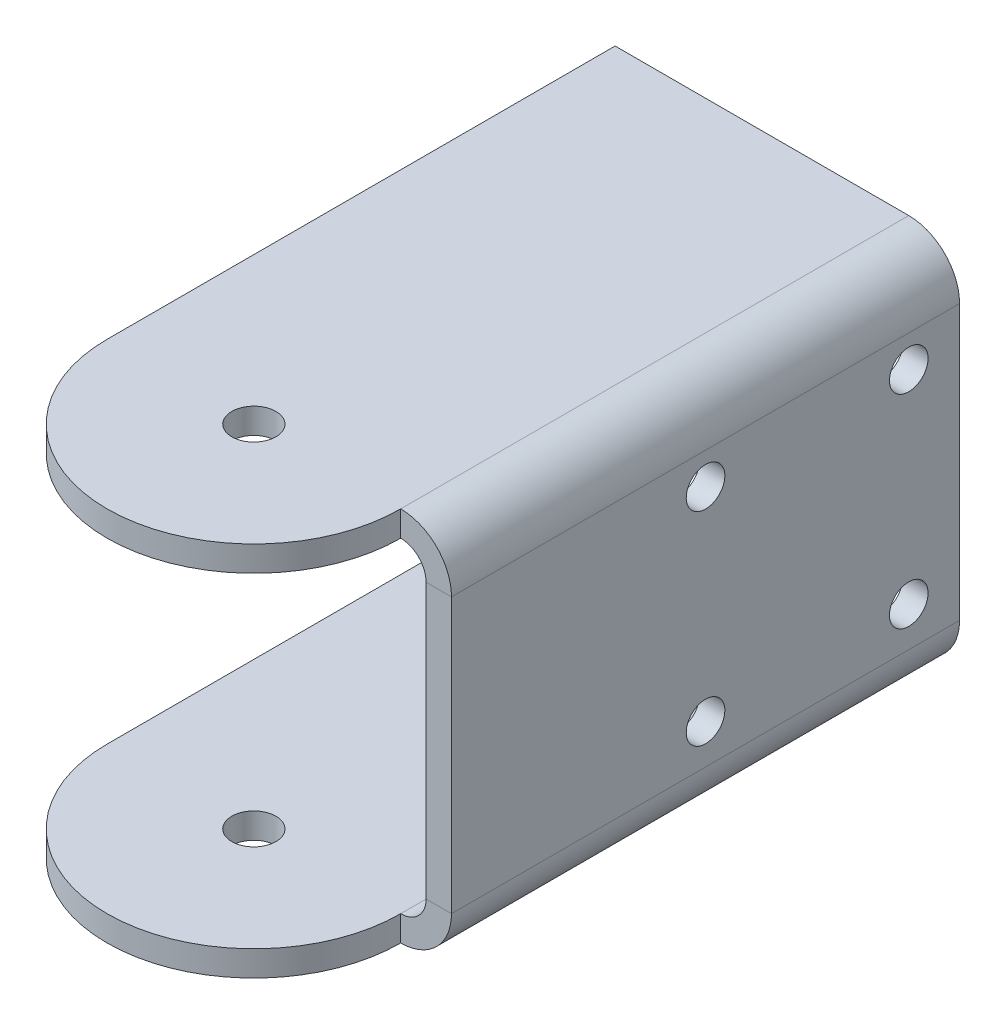
ISO-10303-21;
HEADER;
FILE_DESCRIPTION(('STEP AP214'),'2;1');
FILE_NAME('part.step','',(''),(''),'','','');
FILE_SCHEMA(('AUTOMOTIVE_DESIGN { 1 0 10303 214 1 1 1 1 }'));
ENDSEC;
DATA;
#1=APPLICATION_CONTEXT('core data for automotive mechanical design processes');
#2=APPLICATION_PROTOCOL_DEFINITION('international standard','automotive_design',2000,#1);
#3=PRODUCT_CONTEXT('',#1,'mechanical');
#4=PRODUCT('Part','Part','',(#3));
#5=PRODUCT_RELATED_PRODUCT_CATEGORY('part','',(#4));
#6=PRODUCT_DEFINITION_FORMATION('','',#4);
#7=PRODUCT_DEFINITION_CONTEXT('part definition',#1,'design');
#8=PRODUCT_DEFINITION('design','',#6,#7);
#9=PRODUCT_DEFINITION_SHAPE('','',#8);
#10=(LENGTH_UNIT() NAMED_UNIT(*) SI_UNIT(.MILLI.,.METRE.));
#11=(NAMED_UNIT(*) PLANE_ANGLE_UNIT() SI_UNIT($,.RADIAN.));
#12=(NAMED_UNIT(*) SI_UNIT($,.STERADIAN.) SOLID_ANGLE_UNIT());
#13=UNCERTAINTY_MEASURE_WITH_UNIT(LENGTH_MEASURE(1.E-05),#10,'distance_accuracy_value','');
#14=(GEOMETRIC_REPRESENTATION_CONTEXT(3) GLOBAL_UNCERTAINTY_ASSIGNED_CONTEXT((#13)) GLOBAL_UNIT_ASSIGNED_CONTEXT((#10,
#11,#12)) REPRESENTATION_CONTEXT('',''));
#15=CARTESIAN_POINT('',(0.,0.,0.));
#16=DIRECTION('',(0.,0.,1.));
#17=DIRECTION('',(1.,0.,0.));
#18=AXIS2_PLACEMENT_3D('',#15,#16,#17);
#19=CARTESIAN_POINT('',(-3.17500000000001,20.32,63.5));
#20=DIRECTION('',(0.,0.,1.));
#21=DIRECTION('',(1.,0.,0.));
#22=AXIS2_PLACEMENT_3D('',#19,#20,#21);
#23=PLANE('',#22);
#24=DIRECTION('',(0.,1.,0.));
#25=VECTOR('',#24,1.);
#26=CARTESIAN_POINT('',(-3.17500000000001,20.32,63.5));
#27=LINE('',#26,#25);
#28=CARTESIAN_POINT('',(-3.17500000000001,20.32,63.5));
#29=VERTEX_POINT('',#28);
#30=CARTESIAN_POINT('',(-3.17500000000001,23.495,63.5));
#31=VERTEX_POINT('',#30);
#32=EDGE_CURVE('E11',#29,#31,#27,.T.);
#33=ORIENTED_EDGE('',*,*,#32,.F.);
#34=CARTESIAN_POINT('',(-3.17500000000001,17.145,63.5));
#35=DIRECTION('',(0.,0.,1.));
#36=DIRECTION('',(1.,0.,0.));
#37=AXIS2_PLACEMENT_3D('',#34,#35,#36);
#38=CIRCLE('',#37,3.175);
#39=CARTESIAN_POINT('',(0.,17.145,63.5));
#40=VERTEX_POINT('',#39);
#41=EDGE_CURVE('E154',#29,#40,#38,.F.);
#42=ORIENTED_EDGE('',*,*,#41,.T.);
#43=DIRECTION('',(-1.,0.,0.));
#44=VECTOR('',#43,1.);
#45=CARTESIAN_POINT('',(3.17499999999999,17.145,63.5));
#46=LINE('',#45,#44);
#47=CARTESIAN_POINT('',(3.17499999999999,17.145,63.5));
#48=VERTEX_POINT('',#47);
#49=EDGE_CURVE('E51',#48,#40,#46,.T.);
#50=ORIENTED_EDGE('',*,*,#49,.F.);
#51=CARTESIAN_POINT('',(-3.17500000000001,17.145,63.5));
#52=DIRECTION('',(0.,0.,1.));
#53=DIRECTION('',(1.,0.,0.));
#54=AXIS2_PLACEMENT_3D('',#51,#52,#53);
#55=CIRCLE('',#54,6.35);
#56=EDGE_CURVE('E155',#31,#48,#55,.F.);
#57=ORIENTED_EDGE('',*,*,#56,.F.);
#58=EDGE_LOOP('',(#33,#42,#50,#57));
#59=FACE_BOUND('',#58,.T.);
#60=ADVANCED_FACE('F42',(#59),#23,.T.);
#61=CARTESIAN_POINT('',(0.,17.145,0.));
#62=DIRECTION('',(0.,0.,-1.));
#63=DIRECTION('',(-1.,0.,0.));
#64=AXIS2_PLACEMENT_3D('',#61,#62,#63);
#65=PLANE('',#64);
#66=DIRECTION('',(1.,0.,0.));
#67=VECTOR('',#66,1.);
#68=CARTESIAN_POINT('',(0.,17.145,0.));
#69=LINE('',#68,#67);
#70=CARTESIAN_POINT('',(0.,17.145,0.));
#71=VERTEX_POINT('',#70);
#72=CARTESIAN_POINT('',(3.17499999999999,17.145,0.));
#73=VERTEX_POINT('',#72);
#74=EDGE_CURVE('E248',#71,#73,#69,.T.);
#75=ORIENTED_EDGE('',*,*,#74,.F.);
#76=CARTESIAN_POINT('',(-3.17500000000001,17.145,0.));
#77=DIRECTION('',(0.,0.,1.));
#78=DIRECTION('',(1.,0.,0.));
#79=AXIS2_PLACEMENT_3D('',#76,#77,#78);
#80=CIRCLE('',#79,3.175);
#81=CARTESIAN_POINT('',(-3.17500000000001,20.32,0.));
#82=VERTEX_POINT('',#81);
#83=EDGE_CURVE('E208',#82,#71,#80,.F.);
#84=ORIENTED_EDGE('',*,*,#83,.F.);
#85=DIRECTION('',(0.,-1.,0.));
#86=VECTOR('',#85,1.);
#87=CARTESIAN_POINT('',(-3.17500000000001,23.495,0.));
#88=LINE('',#87,#86);
#89=CARTESIAN_POINT('',(-3.17500000000001,23.495,0.));
#90=VERTEX_POINT('',#89);
#91=EDGE_CURVE('E246',#90,#82,#88,.T.);
#92=ORIENTED_EDGE('',*,*,#91,.F.);
#93=CARTESIAN_POINT('',(-3.17500000000001,17.145,0.));
#94=DIRECTION('',(0.,0.,1.));
#95=DIRECTION('',(1.,0.,0.));
#96=AXIS2_PLACEMENT_3D('',#93,#94,#95);
#97=CIRCLE('',#96,6.35);
#98=EDGE_CURVE('E199',#90,#73,#97,.F.);
#99=ORIENTED_EDGE('',*,*,#98,.T.);
#100=EDGE_LOOP('',(#75,#84,#92,#99));
#101=FACE_BOUND('',#100,.T.);
#102=ADVANCED_FACE('F338',(#101),#65,.T.);
#103=CARTESIAN_POINT('',(-3.17500000000001,23.495,0.));
#104=DIRECTION('',(0.,0.,-1.));
#105=DIRECTION('',(-1.,0.,0.));
#106=AXIS2_PLACEMENT_3D('',#103,#104,#105);
#107=PLANE('',#106);
#108=DIRECTION('',(0.,-1.,0.));
#109=VECTOR('',#108,1.);
#110=CARTESIAN_POINT('',(0.,-20.32,0.));
#111=LINE('',#110,#109);
#112=CARTESIAN_POINT('',(0.,-17.145,0.));
#113=VERTEX_POINT('',#112);
#114=EDGE_CURVE('E211',#71,#113,#111,.T.);
#115=ORIENTED_EDGE('',*,*,#114,.F.);
#116=ORIENTED_EDGE('',*,*,#74,.T.);
#117=DIRECTION('',(0.,-1.,0.));
#118=VECTOR('',#117,1.);
#119=CARTESIAN_POINT('',(3.175,-20.32,0.));
#120=LINE('',#119,#118);
#121=CARTESIAN_POINT('',(3.175,-17.145,0.));
#122=VERTEX_POINT('',#121);
#123=EDGE_CURVE('E197',#73,#122,#120,.T.);
#124=ORIENTED_EDGE('',*,*,#123,.T.);
#125=DIRECTION('',(-1.,0.,0.));
#126=VECTOR('',#125,1.);
#127=CARTESIAN_POINT('',(3.175,-17.145,0.));
#128=LINE('',#127,#126);
#129=EDGE_CURVE('E101',#122,#113,#128,.T.);
#130=ORIENTED_EDGE('',*,*,#129,.T.);
#131=EDGE_LOOP('',(#115,#116,#124,#130));
#132=FACE_BOUND('',#131,.T.);
#133=ADVANCED_FACE('F342',(#132),#107,.T.);
#134=CARTESIAN_POINT('',(0.,-17.145,63.5));
#135=DIRECTION('',(0.,0.,1.));
#136=DIRECTION('',(1.,0.,0.));
#137=AXIS2_PLACEMENT_3D('',#134,#135,#136);
#138=PLANE('',#137);
#139=DIRECTION('',(1.,0.,0.));
#140=VECTOR('',#139,1.);
#141=CARTESIAN_POINT('',(0.,-17.145,63.5));
#142=LINE('',#141,#140);
#143=CARTESIAN_POINT('',(0.,-17.145,63.5));
#144=VERTEX_POINT('',#143);
#145=CARTESIAN_POINT('',(3.175,-17.145,63.5));
#146=VERTEX_POINT('',#145);
#147=EDGE_CURVE('E59',#144,#146,#142,.T.);
#148=ORIENTED_EDGE('',*,*,#147,.F.);
#149=CARTESIAN_POINT('',(-3.175,-17.145,63.5));
#150=DIRECTION('',(0.,0.,1.));
#151=DIRECTION('',(1.,0.,0.));
#152=AXIS2_PLACEMENT_3D('',#149,#150,#151);
#153=CIRCLE('',#152,3.175);
#154=CARTESIAN_POINT('',(-3.17500000000001,-20.32,63.5));
#155=VERTEX_POINT('',#154);
#156=EDGE_CURVE('E187',#144,#155,#153,.F.);
#157=ORIENTED_EDGE('',*,*,#156,.T.);
#158=DIRECTION('',(0.,1.,0.));
#159=VECTOR('',#158,1.);
#160=CARTESIAN_POINT('',(-3.175,-23.495,63.5));
#161=LINE('',#160,#159);
#162=CARTESIAN_POINT('',(-3.17500000000001,-23.495,63.5));
#163=VERTEX_POINT('',#162);
#164=EDGE_CURVE('E242',#163,#155,#161,.T.);
#165=ORIENTED_EDGE('',*,*,#164,.F.);
#166=CARTESIAN_POINT('',(-3.175,-17.145,63.5));
#167=DIRECTION('',(0.,0.,1.));
#168=DIRECTION('',(1.,0.,0.));
#169=AXIS2_PLACEMENT_3D('',#166,#167,#168);
#170=CIRCLE('',#169,6.35);
#171=EDGE_CURVE('E174',#146,#163,#170,.F.);
#172=ORIENTED_EDGE('',*,*,#171,.F.);
#173=EDGE_LOOP('',(#148,#157,#165,#172));
#174=FACE_BOUND('',#173,.T.);
#175=ADVANCED_FACE('F271',(#174),#138,.T.);
#176=CARTESIAN_POINT('',(-3.175,-23.495,63.5));
#177=DIRECTION('',(0.,0.,1.));
#178=DIRECTION('',(1.,0.,0.));
#179=AXIS2_PLACEMENT_3D('',#176,#177,#178);
#180=PLANE('',#179);
#181=DIRECTION('',(0.,-1.,0.));
#182=VECTOR('',#181,1.);
#183=CARTESIAN_POINT('',(0.,-20.32,63.5));
#184=LINE('',#183,#182);
#185=EDGE_CURVE('E185',#40,#144,#184,.T.);
#186=ORIENTED_EDGE('',*,*,#185,.T.);
#187=ORIENTED_EDGE('',*,*,#147,.T.);
#188=DIRECTION('',(0.,-1.,0.));
#189=VECTOR('',#188,1.);
#190=CARTESIAN_POINT('',(3.175,-20.32,63.5));
#191=LINE('',#190,#189);
#192=EDGE_CURVE('E178',#48,#146,#191,.T.);
#193=ORIENTED_EDGE('',*,*,#192,.F.);
#194=ORIENTED_EDGE('',*,*,#49,.T.);
#195=EDGE_LOOP('',(#186,#187,#193,#194));
#196=FACE_BOUND('',#195,.T.);
#197=ADVANCED_FACE('F252',(#196),#180,.T.);
#198=CARTESIAN_POINT('',(-3.175,-20.32,0.));
#199=DIRECTION('',(0.,0.,-1.));
#200=DIRECTION('',(-1.,0.,0.));
#201=AXIS2_PLACEMENT_3D('',#198,#199,#200);
#202=PLANE('',#201);
#203=DIRECTION('',(0.,-1.,0.));
#204=VECTOR('',#203,1.);
#205=CARTESIAN_POINT('',(-3.175,-20.32,0.));
#206=LINE('',#205,#204);
#207=CARTESIAN_POINT('',(-3.175,-20.32,0.));
#208=VERTEX_POINT('',#207);
#209=CARTESIAN_POINT('',(-3.175,-23.495,0.));
#210=VERTEX_POINT('',#209);
#211=EDGE_CURVE('E108',#208,#210,#206,.T.);
#212=ORIENTED_EDGE('',*,*,#211,.F.);
#213=CARTESIAN_POINT('',(-3.175,-17.145,0.));
#214=DIRECTION('',(0.,0.,1.));
#215=DIRECTION('',(1.,0.,0.));
#216=AXIS2_PLACEMENT_3D('',#213,#214,#215);
#217=CIRCLE('',#216,3.175);
#218=EDGE_CURVE('E175',#113,#208,#217,.F.);
#219=ORIENTED_EDGE('',*,*,#218,.F.);
#220=ORIENTED_EDGE('',*,*,#129,.F.);
#221=CARTESIAN_POINT('',(-3.175,-17.145,0.));
#222=DIRECTION('',(0.,0.,1.));
#223=DIRECTION('',(1.,0.,0.));
#224=AXIS2_PLACEMENT_3D('',#221,#222,#223);
#225=CIRCLE('',#224,6.35);
#226=EDGE_CURVE('E195',#122,#210,#225,.F.);
#227=ORIENTED_EDGE('',*,*,#226,.T.);
#228=EDGE_LOOP('',(#212,#219,#220,#227));
#229=FACE_BOUND('',#228,.T.);
#230=ADVANCED_FACE('F353',(#229),#202,.T.);
#231=CARTESIAN_POINT('',(3.175,-17.145,0.));
#232=DIRECTION('',(0.,0.,-1.));
#233=DIRECTION('',(-1.,0.,0.));
#234=AXIS2_PLACEMENT_3D('',#231,#232,#233);
#235=PLANE('',#234);
#236=DIRECTION('',(-1.,0.,0.));
#237=VECTOR('',#236,1.);
#238=CARTESIAN_POINT('',(0.,-20.32,0.));
#239=LINE('',#238,#237);
#240=CARTESIAN_POINT('',(-39.878,-20.32,0.));
#241=VERTEX_POINT('',#240);
#242=EDGE_CURVE('E161',#208,#241,#239,.T.);
#243=ORIENTED_EDGE('',*,*,#242,.F.);
#244=ORIENTED_EDGE('',*,*,#211,.T.);
#245=DIRECTION('',(1.,0.,0.));
#246=VECTOR('',#245,1.);
#247=CARTESIAN_POINT('',(0.,-23.495,0.));
#248=LINE('',#247,#246);
#249=CARTESIAN_POINT('',(-39.878,-23.495,0.));
#250=VERTEX_POINT('',#249);
#251=EDGE_CURVE('E192',#210,#250,#248,.F.);
#252=ORIENTED_EDGE('',*,*,#251,.T.);
#253=DIRECTION('',(0.,1.,0.));
#254=VECTOR('',#253,1.);
#255=CARTESIAN_POINT('',(-39.878,-23.495,0.));
#256=LINE('',#255,#254);
#257=EDGE_CURVE('E164',#250,#241,#256,.T.);
#258=ORIENTED_EDGE('',*,*,#257,.T.);
#259=EDGE_LOOP('',(#243,#244,#252,#258));
#260=FACE_BOUND('',#259,.T.);
#261=ADVANCED_FACE('F356',(#260),#235,.T.);
#262=CARTESIAN_POINT('',(0.,-20.32,63.5));
#263=DIRECTION('',(0.,-1.,0.));
#264=DIRECTION('',(0.,0.,-1.));
#265=AXIS2_PLACEMENT_3D('',#262,#263,#264);
#266=PLANE('',#265);
#267=CARTESIAN_POINT('',(-21.5265,-20.32,63.5));
#268=DIRECTION('',(0.,-1.,0.));
#269=DIRECTION('',(0.,0.,-1.));
#270=AXIS2_PLACEMENT_3D('',#267,#268,#269);
#271=CIRCLE('',#270,2.753999953);
#272=CARTESIAN_POINT('',(-21.5265,-20.32,60.746000047));
#273=VERTEX_POINT('',#272);
#274=EDGE_CURVE('E295',#273,#273,#271,.T.);
#275=ORIENTED_EDGE('',*,*,#274,.T.);
#276=EDGE_LOOP('',(#275));
#277=FACE_BOUND('',#276,.T.);
#278=ORIENTED_EDGE('',*,*,#242,.T.);
#279=DIRECTION('',(0.,0.,-1.));
#280=VECTOR('',#279,1.);
#281=CARTESIAN_POINT('',(-39.878,-20.32,63.5));
#282=LINE('',#281,#280);
#283=CARTESIAN_POINT('',(-39.878,-20.32,63.4999999999999));
#284=VERTEX_POINT('',#283);
#285=EDGE_CURVE('E238',#284,#241,#282,.T.);
#286=ORIENTED_EDGE('',*,*,#285,.F.);
#287=CARTESIAN_POINT('',(-21.5265,-20.32,63.4999999999999));
#288=DIRECTION('',(0.,-1.,0.));
#289=DIRECTION('',(0.,0.,1.));
#290=AXIS2_PLACEMENT_3D('',#287,#288,#289);
#291=CIRCLE('',#290,18.3515);
#292=EDGE_CURVE('E166',#155,#284,#291,.T.);
#293=ORIENTED_EDGE('',*,*,#292,.F.);
#294=DIRECTION('',(0.,0.,-1.));
#295=VECTOR('',#294,1.);
#296=CARTESIAN_POINT('',(-3.175,-20.32,63.5));
#297=LINE('',#296,#295);
#298=EDGE_CURVE('E188',#155,#208,#297,.T.);
#299=ORIENTED_EDGE('',*,*,#298,.T.);
#300=EDGE_LOOP('',(#278,#286,#293,#299));
#301=FACE_BOUND('',#300,.T.);
#302=ADVANCED_FACE('F359',(#277,#301),#266,.F.);
#303=CARTESIAN_POINT('',(-39.878,-23.495,63.5));
#304=DIRECTION('',(-1.,0.,0.));
#305=DIRECTION('',(0.,0.,1.));
#306=AXIS2_PLACEMENT_3D('',#303,#304,#305);
#307=PLANE('',#306);
#308=ORIENTED_EDGE('',*,*,#257,.F.);
#309=DIRECTION('',(0.,0.,-1.));
#310=VECTOR('',#309,1.);
#311=CARTESIAN_POINT('',(-39.878,-23.495,63.5));
#312=LINE('',#311,#310);
#313=CARTESIAN_POINT('',(-39.878,-23.495,63.5));
#314=VERTEX_POINT('',#313);
#315=EDGE_CURVE('E236',#314,#250,#312,.T.);
#316=ORIENTED_EDGE('',*,*,#315,.F.);
#317=DIRECTION('',(0.,1.,0.));
#318=VECTOR('',#317,1.);
#319=CARTESIAN_POINT('',(-39.878,-23.495,63.5));
#320=LINE('',#319,#318);
#321=EDGE_CURVE('E171',#314,#284,#320,.T.);
#322=ORIENTED_EDGE('',*,*,#321,.T.);
#323=ORIENTED_EDGE('',*,*,#285,.T.);
#324=EDGE_LOOP('',(#308,#316,#322,#323));
#325=FACE_BOUND('',#324,.T.);
#326=ADVANCED_FACE('F363',(#325),#307,.T.);
#327=CARTESIAN_POINT('',(0.,-23.495,63.5));
#328=DIRECTION('',(0.,-1.,0.));
#329=DIRECTION('',(0.,0.,-1.));
#330=AXIS2_PLACEMENT_3D('',#327,#328,#329);
#331=PLANE('',#330);
#332=CARTESIAN_POINT('',(-21.5265,-23.495,63.5));
#333=DIRECTION('',(0.,1.,0.));
#334=DIRECTION('',(-1.,0.,0.));
#335=AXIS2_PLACEMENT_3D('',#332,#333,#334);
#336=CIRCLE('',#335,2.753999953);
#337=CARTESIAN_POINT('',(-24.280499953,-23.495,63.5));
#338=VERTEX_POINT('',#337);
#339=EDGE_CURVE('E314',#338,#338,#336,.T.);
#340=ORIENTED_EDGE('',*,*,#339,.T.);
#341=EDGE_LOOP('',(#340));
#342=FACE_BOUND('',#341,.T.);
#343=ORIENTED_EDGE('',*,*,#251,.F.);
#344=DIRECTION('',(0.,0.,-1.));
#345=VECTOR('',#344,1.);
#346=CARTESIAN_POINT('',(-3.175,-23.495,63.5));
#347=LINE('',#346,#345);
#348=EDGE_CURVE('E233',#163,#210,#347,.T.);
#349=ORIENTED_EDGE('',*,*,#348,.F.);
#350=CARTESIAN_POINT('',(-21.5265,-23.495,63.4999999999999));
#351=DIRECTION('',(0.,-1.,0.));
#352=DIRECTION('',(0.,0.,1.));
#353=AXIS2_PLACEMENT_3D('',#350,#351,#352);
#354=CIRCLE('',#353,18.3515);
#355=EDGE_CURVE('E116',#163,#314,#354,.T.);
#356=ORIENTED_EDGE('',*,*,#355,.T.);
#357=ORIENTED_EDGE('',*,*,#315,.T.);
#358=EDGE_LOOP('',(#343,#349,#356,#357));
#359=FACE_BOUND('',#358,.T.);
#360=ADVANCED_FACE('F367',(#342,#359),#331,.T.);
#361=CARTESIAN_POINT('',(-3.175,-17.145,63.5));
#362=DIRECTION('',(0.,0.,-1.));
#363=DIRECTION('',(-1.,0.,0.));
#364=AXIS2_PLACEMENT_3D('',#361,#362,#363);
#365=CYLINDRICAL_SURFACE('',#364,6.35);
#366=ORIENTED_EDGE('',*,*,#226,.F.);
#367=DIRECTION('',(0.,0.,-1.));
#368=VECTOR('',#367,1.);
#369=CARTESIAN_POINT('',(3.175,-17.145,63.5));
#370=LINE('',#369,#368);
#371=EDGE_CURVE('E230',#146,#122,#370,.T.);
#372=ORIENTED_EDGE('',*,*,#371,.F.);
#373=ORIENTED_EDGE('',*,*,#171,.T.);
#374=ORIENTED_EDGE('',*,*,#348,.T.);
#375=EDGE_LOOP('',(#366,#372,#373,#374));
#376=FACE_BOUND('',#375,.T.);
#377=ADVANCED_FACE('F371',(#376),#365,.T.);
#378=CARTESIAN_POINT('',(3.175,-20.32,63.5));
#379=DIRECTION('',(1.,0.,0.));
#380=DIRECTION('',(0.,1.,0.));
#381=AXIS2_PLACEMENT_3D('',#378,#379,#380);
#382=PLANE('',#381);
#383=CARTESIAN_POINT('',(3.175,-12.2133720603264,6.35));
#384=DIRECTION('',(1.,0.,0.));
#385=DIRECTION('',(0.,1.,0.));
#386=AXIS2_PLACEMENT_3D('',#383,#384,#385);
#387=CIRCLE('',#386,2.413);
#388=CARTESIAN_POINT('',(3.175,-9.8003720603264,6.35));
#389=VERTEX_POINT('',#388);
#390=EDGE_CURVE('E294',#389,#389,#387,.T.);
#391=ORIENTED_EDGE('',*,*,#390,.F.);
#392=EDGE_LOOP('',(#391));
#393=FACE_BOUND('',#392,.T.);
#394=CARTESIAN_POINT('',(3.175,-12.2133720603264,31.75));
#395=DIRECTION('',(1.,0.,0.));
#396=DIRECTION('',(0.,1.,0.));
#397=AXIS2_PLACEMENT_3D('',#394,#395,#396);
#398=CIRCLE('',#397,2.41299999999999);
#399=CARTESIAN_POINT('',(3.175,-9.8003720603264,31.75));
#400=VERTEX_POINT('',#399);
#401=EDGE_CURVE('E301',#400,#400,#398,.T.);
#402=ORIENTED_EDGE('',*,*,#401,.F.);
#403=EDGE_LOOP('',(#402));
#404=FACE_BOUND('',#403,.T.);
#405=CARTESIAN_POINT('',(3.17499999999999,13.1866279396736,31.75));
#406=DIRECTION('',(1.,0.,0.));
#407=DIRECTION('',(0.,1.,0.));
#408=AXIS2_PLACEMENT_3D('',#405,#406,#407);
#409=CIRCLE('',#408,2.41299999999999);
#410=CARTESIAN_POINT('',(3.17499999999999,15.5996279396736,31.75));
#411=VERTEX_POINT('',#410);
#412=EDGE_CURVE('E288',#411,#411,#409,.T.);
#413=ORIENTED_EDGE('',*,*,#412,.F.);
#414=EDGE_LOOP('',(#413));
#415=FACE_BOUND('',#414,.T.);
#416=CARTESIAN_POINT('',(3.17499999999999,13.1866279396736,6.35));
#417=DIRECTION('',(1.,0.,0.));
#418=DIRECTION('',(0.,1.,0.));
#419=AXIS2_PLACEMENT_3D('',#416,#417,#418);
#420=CIRCLE('',#419,2.413);
#421=CARTESIAN_POINT('',(3.17499999999999,15.5996279396736,6.35));
#422=VERTEX_POINT('',#421);
#423=EDGE_CURVE('E283',#422,#422,#420,.T.);
#424=ORIENTED_EDGE('',*,*,#423,.F.);
#425=EDGE_LOOP('',(#424));
#426=FACE_BOUND('',#425,.T.);
#427=ORIENTED_EDGE('',*,*,#123,.F.);
#428=DIRECTION('',(0.,0.,-1.));
#429=VECTOR('',#428,1.);
#430=CARTESIAN_POINT('',(3.17499999999999,17.145,63.5));
#431=LINE('',#430,#429);
#432=EDGE_CURVE('E227',#48,#73,#431,.T.);
#433=ORIENTED_EDGE('',*,*,#432,.F.);
#434=ORIENTED_EDGE('',*,*,#192,.T.);
#435=ORIENTED_EDGE('',*,*,#371,.T.);
#436=EDGE_LOOP('',(#427,#433,#434,#435));
#437=FACE_BOUND('',#436,.T.);
#438=ADVANCED_FACE('F374',(#393,#404,#415,#426,#437),#382,.T.);
#439=CARTESIAN_POINT('',(-3.17500000000001,17.145,63.5));
#440=DIRECTION('',(0.,0.,-1.));
#441=DIRECTION('',(-1.,0.,0.));
#442=AXIS2_PLACEMENT_3D('',#439,#440,#441);
#443=CYLINDRICAL_SURFACE('',#442,6.35);
#444=ORIENTED_EDGE('',*,*,#98,.F.);
#445=DIRECTION('',(0.,0.,-1.));
#446=VECTOR('',#445,1.);
#447=CARTESIAN_POINT('',(-3.17500000000001,23.495,63.5));
#448=LINE('',#447,#446);
#449=EDGE_CURVE('E224',#31,#90,#448,.T.);
#450=ORIENTED_EDGE('',*,*,#449,.F.);
#451=ORIENTED_EDGE('',*,*,#56,.T.);
#452=ORIENTED_EDGE('',*,*,#432,.T.);
#453=EDGE_LOOP('',(#444,#450,#451,#452));
#454=FACE_BOUND('',#453,.T.);
#455=ADVANCED_FACE('F378',(#454),#443,.T.);
#456=CARTESIAN_POINT('',(0.,23.495,63.5));
#457=DIRECTION('',(0.,1.,0.));
#458=DIRECTION('',(-1.,0.,0.));
#459=AXIS2_PLACEMENT_3D('',#456,#457,#458);
#460=PLANE('',#459);
#461=CARTESIAN_POINT('',(-21.5265,23.495,63.5));
#462=DIRECTION('',(0.,1.,0.));
#463=DIRECTION('',(-1.,0.,0.));
#464=AXIS2_PLACEMENT_3D('',#461,#462,#463);
#465=CIRCLE('',#464,2.753999953);
#466=CARTESIAN_POINT('',(-24.280499953,23.495,63.5));
#467=VERTEX_POINT('',#466);
#468=EDGE_CURVE('E311',#467,#467,#465,.T.);
#469=ORIENTED_EDGE('',*,*,#468,.F.);
#470=EDGE_LOOP('',(#469));
#471=FACE_BOUND('',#470,.T.);
#472=DIRECTION('',(1.,0.,0.));
#473=VECTOR('',#472,1.);
#474=CARTESIAN_POINT('',(0.,23.495,0.));
#475=LINE('',#474,#473);
#476=CARTESIAN_POINT('',(-39.878,23.495,0.));
#477=VERTEX_POINT('',#476);
#478=EDGE_CURVE('E202',#477,#90,#475,.T.);
#479=ORIENTED_EDGE('',*,*,#478,.F.);
#480=DIRECTION('',(0.,0.,-1.));
#481=VECTOR('',#480,1.);
#482=CARTESIAN_POINT('',(-39.878,23.495,63.5));
#483=LINE('',#482,#481);
#484=CARTESIAN_POINT('',(-39.878,23.495,63.5));
#485=VERTEX_POINT('',#484);
#486=EDGE_CURVE('E145',#485,#477,#483,.T.);
#487=ORIENTED_EDGE('',*,*,#486,.F.);
#488=CARTESIAN_POINT('',(-21.5265,23.495,63.5));
#489=DIRECTION('',(0.,1.,0.));
#490=DIRECTION('',(-1.,0.,0.));
#491=AXIS2_PLACEMENT_3D('',#488,#489,#490);
#492=CIRCLE('',#491,18.3515);
#493=EDGE_CURVE('E153',#485,#31,#492,.T.);
#494=ORIENTED_EDGE('',*,*,#493,.T.);
#495=ORIENTED_EDGE('',*,*,#449,.T.);
#496=EDGE_LOOP('',(#479,#487,#494,#495));
#497=FACE_BOUND('',#496,.T.);
#498=ADVANCED_FACE('F382',(#471,#497),#460,.T.);
#499=CARTESIAN_POINT('',(-39.878,20.32,63.5));
#500=DIRECTION('',(-1.,0.,0.));
#501=DIRECTION('',(0.,0.,1.));
#502=AXIS2_PLACEMENT_3D('',#499,#500,#501);
#503=PLANE('',#502);
#504=DIRECTION('',(0.,1.,0.));
#505=VECTOR('',#504,1.);
#506=CARTESIAN_POINT('',(-39.878,20.32,0.));
#507=LINE('',#506,#505);
#508=CARTESIAN_POINT('',(-39.878,20.32,0.));
#509=VERTEX_POINT('',#508);
#510=EDGE_CURVE('E140',#509,#477,#507,.T.);
#511=ORIENTED_EDGE('',*,*,#510,.F.);
#512=DIRECTION('',(0.,0.,-1.));
#513=VECTOR('',#512,1.);
#514=CARTESIAN_POINT('',(-39.878,20.32,63.5));
#515=LINE('',#514,#513);
#516=CARTESIAN_POINT('',(-39.878,20.32,63.5));
#517=VERTEX_POINT('',#516);
#518=EDGE_CURVE('E134',#517,#509,#515,.T.);
#519=ORIENTED_EDGE('',*,*,#518,.F.);
#520=DIRECTION('',(0.,1.,0.));
#521=VECTOR('',#520,1.);
#522=CARTESIAN_POINT('',(-39.878,20.32,63.5));
#523=LINE('',#522,#521);
#524=EDGE_CURVE('E137',#517,#485,#523,.T.);
#525=ORIENTED_EDGE('',*,*,#524,.T.);
#526=ORIENTED_EDGE('',*,*,#486,.T.);
#527=EDGE_LOOP('',(#511,#519,#525,#526));
#528=FACE_BOUND('',#527,.T.);
#529=ADVANCED_FACE('F136',(#528),#503,.T.);
#530=CARTESIAN_POINT('',(0.,20.32,63.5));
#531=DIRECTION('',(0.,1.,0.));
#532=DIRECTION('',(-1.,0.,0.));
#533=AXIS2_PLACEMENT_3D('',#530,#531,#532);
#534=PLANE('',#533);
#535=CARTESIAN_POINT('',(-21.5265,20.32,63.5));
#536=DIRECTION('',(0.,1.,0.));
#537=DIRECTION('',(-1.,0.,0.));
#538=AXIS2_PLACEMENT_3D('',#535,#536,#537);
#539=CIRCLE('',#538,2.753999953);
#540=CARTESIAN_POINT('',(-24.280499953,20.32,63.5));
#541=VERTEX_POINT('',#540);
#542=EDGE_CURVE('E45',#541,#541,#539,.T.);
#543=ORIENTED_EDGE('',*,*,#542,.T.);
#544=EDGE_LOOP('',(#543));
#545=FACE_BOUND('',#544,.T.);
#546=DIRECTION('',(1.,0.,0.));
#547=VECTOR('',#546,1.);
#548=CARTESIAN_POINT('',(0.,20.32,0.));
#549=LINE('',#548,#547);
#550=EDGE_CURVE('E206',#509,#82,#549,.T.);
#551=ORIENTED_EDGE('',*,*,#550,.T.);
#552=DIRECTION('',(0.,0.,-1.));
#553=VECTOR('',#552,1.);
#554=CARTESIAN_POINT('',(-3.17500000000001,20.32,63.5));
#555=LINE('',#554,#553);
#556=EDGE_CURVE('E146',#29,#82,#555,.T.);
#557=ORIENTED_EDGE('',*,*,#556,.F.);
#558=CARTESIAN_POINT('',(-21.5265,20.32,63.5));
#559=DIRECTION('',(0.,1.,0.));
#560=DIRECTION('',(-1.,0.,0.));
#561=AXIS2_PLACEMENT_3D('',#558,#559,#560);
#562=CIRCLE('',#561,18.3515);
#563=EDGE_CURVE('E151',#517,#29,#562,.T.);
#564=ORIENTED_EDGE('',*,*,#563,.F.);
#565=ORIENTED_EDGE('',*,*,#518,.T.);
#566=EDGE_LOOP('',(#551,#557,#564,#565));
#567=FACE_BOUND('',#566,.T.);
#568=ADVANCED_FACE('F158',(#545,#567),#534,.F.);
#569=CARTESIAN_POINT('',(-3.17500000000001,17.145,63.5));
#570=DIRECTION('',(0.,0.,-1.));
#571=DIRECTION('',(-1.,0.,0.));
#572=AXIS2_PLACEMENT_3D('',#569,#570,#571);
#573=CYLINDRICAL_SURFACE('',#572,3.175);
#574=ORIENTED_EDGE('',*,*,#83,.T.);
#575=DIRECTION('',(0.,0.,-1.));
#576=VECTOR('',#575,1.);
#577=CARTESIAN_POINT('',(0.,17.145,63.5));
#578=LINE('',#577,#576);
#579=EDGE_CURVE('E219',#40,#71,#578,.T.);
#580=ORIENTED_EDGE('',*,*,#579,.F.);
#581=ORIENTED_EDGE('',*,*,#41,.F.);
#582=ORIENTED_EDGE('',*,*,#556,.T.);
#583=EDGE_LOOP('',(#574,#580,#581,#582));
#584=FACE_BOUND('',#583,.T.);
#585=ADVANCED_FACE('F261',(#584),#573,.F.);
#586=CARTESIAN_POINT('',(0.,-20.32,63.5));
#587=DIRECTION('',(1.,0.,0.));
#588=DIRECTION('',(0.,1.,0.));
#589=AXIS2_PLACEMENT_3D('',#586,#587,#588);
#590=PLANE('',#589);
#591=CARTESIAN_POINT('',(0.,-12.2133720603264,6.35));
#592=DIRECTION('',(1.,0.,0.));
#593=DIRECTION('',(0.,1.,0.));
#594=AXIS2_PLACEMENT_3D('',#591,#592,#593);
#595=CIRCLE('',#594,2.413);
#596=CARTESIAN_POINT('',(0.,-9.8003720603264,6.35));
#597=VERTEX_POINT('',#596);
#598=EDGE_CURVE('E291',#597,#597,#595,.T.);
#599=ORIENTED_EDGE('',*,*,#598,.T.);
#600=EDGE_LOOP('',(#599));
#601=FACE_BOUND('',#600,.T.);
#602=CARTESIAN_POINT('',(0.,-12.2133720603264,31.75));
#603=DIRECTION('',(1.,0.,0.));
#604=DIRECTION('',(0.,1.,0.));
#605=AXIS2_PLACEMENT_3D('',#602,#603,#604);
#606=CIRCLE('',#605,2.41299999999999);
#607=CARTESIAN_POINT('',(0.,-9.8003720603264,31.75));
#608=VERTEX_POINT('',#607);
#609=EDGE_CURVE('E298',#608,#608,#606,.T.);
#610=ORIENTED_EDGE('',*,*,#609,.T.);
#611=EDGE_LOOP('',(#610));
#612=FACE_BOUND('',#611,.T.);
#613=CARTESIAN_POINT('',(0.,13.1866279396736,31.75));
#614=DIRECTION('',(1.,0.,0.));
#615=DIRECTION('',(0.,1.,0.));
#616=AXIS2_PLACEMENT_3D('',#613,#614,#615);
#617=CIRCLE('',#616,2.41299999999999);
#618=CARTESIAN_POINT('',(0.,15.5996279396736,31.75));
#619=VERTEX_POINT('',#618);
#620=EDGE_CURVE('E304',#619,#619,#617,.T.);
#621=ORIENTED_EDGE('',*,*,#620,.T.);
#622=EDGE_LOOP('',(#621));
#623=FACE_BOUND('',#622,.T.);
#624=CARTESIAN_POINT('',(0.,13.1866279396736,6.35));
#625=DIRECTION('',(1.,0.,0.));
#626=DIRECTION('',(0.,1.,0.));
#627=AXIS2_PLACEMENT_3D('',#624,#625,#626);
#628=CIRCLE('',#627,2.413);
#629=CARTESIAN_POINT('',(0.,15.5996279396736,6.35));
#630=VERTEX_POINT('',#629);
#631=EDGE_CURVE('E281',#630,#630,#628,.T.);
#632=ORIENTED_EDGE('',*,*,#631,.T.);
#633=EDGE_LOOP('',(#632));
#634=FACE_BOUND('',#633,.T.);
#635=ORIENTED_EDGE('',*,*,#114,.T.);
#636=DIRECTION('',(0.,0.,-1.));
#637=VECTOR('',#636,1.);
#638=CARTESIAN_POINT('',(0.,-17.145,63.5));
#639=LINE('',#638,#637);
#640=EDGE_CURVE('E216',#144,#113,#639,.T.);
#641=ORIENTED_EDGE('',*,*,#640,.F.);
#642=ORIENTED_EDGE('',*,*,#185,.F.);
#643=ORIENTED_EDGE('',*,*,#579,.T.);
#644=EDGE_LOOP('',(#635,#641,#642,#643));
#645=FACE_BOUND('',#644,.T.);
#646=ADVANCED_FACE('F264',(#601,#612,#623,#634,#645),#590,.F.);
#647=CARTESIAN_POINT('',(-3.175,-17.145,63.5));
#648=DIRECTION('',(0.,0.,-1.));
#649=DIRECTION('',(-1.,0.,0.));
#650=AXIS2_PLACEMENT_3D('',#647,#648,#649);
#651=CYLINDRICAL_SURFACE('',#650,3.175);
#652=ORIENTED_EDGE('',*,*,#218,.T.);
#653=ORIENTED_EDGE('',*,*,#298,.F.);
#654=ORIENTED_EDGE('',*,*,#156,.F.);
#655=ORIENTED_EDGE('',*,*,#640,.T.);
#656=EDGE_LOOP('',(#652,#653,#654,#655));
#657=FACE_BOUND('',#656,.T.);
#658=ADVANCED_FACE('F268',(#657),#651,.F.);
#659=CARTESIAN_POINT('',(-3.175,-17.145,0.));
#660=DIRECTION('',(0.,0.,1.));
#661=DIRECTION('',(1.,0.,0.));
#662=AXIS2_PLACEMENT_3D('',#659,#660,#661);
#663=PLANE('',#662);
#664=ORIENTED_EDGE('',*,*,#478,.T.);
#665=ORIENTED_EDGE('',*,*,#91,.T.);
#666=ORIENTED_EDGE('',*,*,#550,.F.);
#667=ORIENTED_EDGE('',*,*,#510,.T.);
#668=EDGE_LOOP('',(#664,#665,#666,#667));
#669=FACE_BOUND('',#668,.T.);
#670=ADVANCED_FACE('F398',(#669),#663,.F.);
#671=CARTESIAN_POINT('',(-21.5265,20.32,63.5));
#672=DIRECTION('',(0.,1.,0.));
#673=DIRECTION('',(-1.,0.,0.));
#674=AXIS2_PLACEMENT_3D('',#671,#672,#673);
#675=CYLINDRICAL_SURFACE('',#674,18.3515);
#676=ORIENTED_EDGE('',*,*,#493,.F.);
#677=ORIENTED_EDGE('',*,*,#524,.F.);
#678=ORIENTED_EDGE('',*,*,#563,.T.);
#679=ORIENTED_EDGE('',*,*,#32,.T.);
#680=EDGE_LOOP('',(#676,#677,#678,#679));
#681=FACE_BOUND('',#680,.T.);
#682=ADVANCED_FACE('F150',(#681),#675,.T.);
#683=CARTESIAN_POINT('',(-21.5265,-20.32,63.4999999999999));
#684=DIRECTION('',(0.,-1.,0.));
#685=DIRECTION('',(0.,0.,-1.));
#686=AXIS2_PLACEMENT_3D('',#683,#684,#685);
#687=CYLINDRICAL_SURFACE('',#686,18.3515);
#688=ORIENTED_EDGE('',*,*,#355,.F.);
#689=ORIENTED_EDGE('',*,*,#164,.T.);
#690=ORIENTED_EDGE('',*,*,#292,.T.);
#691=ORIENTED_EDGE('',*,*,#321,.F.);
#692=EDGE_LOOP('',(#688,#689,#690,#691));
#693=FACE_BOUND('',#692,.T.);
#694=ADVANCED_FACE('F279',(#693),#687,.T.);
#695=CARTESIAN_POINT('',(0.,13.1866279396736,6.35));
#696=DIRECTION('',(1.,0.,0.));
#697=DIRECTION('',(0.,1.,0.));
#698=AXIS2_PLACEMENT_3D('',#695,#696,#697);
#699=CYLINDRICAL_SURFACE('',#698,2.413);
#700=ORIENTED_EDGE('',*,*,#631,.F.);
#701=EDGE_LOOP('',(#700));
#702=FACE_BOUND('',#701,.T.);
#703=ORIENTED_EDGE('',*,*,#423,.T.);
#704=EDGE_LOOP('',(#703));
#705=FACE_BOUND('',#704,.T.);
#706=ADVANCED_FACE('F406',(#702,#705),#699,.F.);
#707=CARTESIAN_POINT('',(0.,13.1866279396736,31.75));
#708=DIRECTION('',(1.,0.,0.));
#709=DIRECTION('',(0.,1.,0.));
#710=AXIS2_PLACEMENT_3D('',#707,#708,#709);
#711=CYLINDRICAL_SURFACE('',#710,2.41299999999999);
#712=ORIENTED_EDGE('',*,*,#620,.F.);
#713=EDGE_LOOP('',(#712));
#714=FACE_BOUND('',#713,.T.);
#715=ORIENTED_EDGE('',*,*,#412,.T.);
#716=EDGE_LOOP('',(#715));
#717=FACE_BOUND('',#716,.T.);
#718=ADVANCED_FACE('F408',(#714,#717),#711,.F.);
#719=CARTESIAN_POINT('',(0.,-12.2133720603264,31.75));
#720=DIRECTION('',(1.,0.,0.));
#721=DIRECTION('',(0.,1.,0.));
#722=AXIS2_PLACEMENT_3D('',#719,#720,#721);
#723=CYLINDRICAL_SURFACE('',#722,2.41299999999999);
#724=ORIENTED_EDGE('',*,*,#609,.F.);
#725=EDGE_LOOP('',(#724));
#726=FACE_BOUND('',#725,.T.);
#727=ORIENTED_EDGE('',*,*,#401,.T.);
#728=EDGE_LOOP('',(#727));
#729=FACE_BOUND('',#728,.T.);
#730=ADVANCED_FACE('F333',(#726,#729),#723,.F.);
#731=CARTESIAN_POINT('',(0.,-12.2133720603264,6.35));
#732=DIRECTION('',(1.,0.,0.));
#733=DIRECTION('',(0.,1.,0.));
#734=AXIS2_PLACEMENT_3D('',#731,#732,#733);
#735=CYLINDRICAL_SURFACE('',#734,2.413);
#736=ORIENTED_EDGE('',*,*,#598,.F.);
#737=EDGE_LOOP('',(#736));
#738=FACE_BOUND('',#737,.T.);
#739=ORIENTED_EDGE('',*,*,#390,.T.);
#740=EDGE_LOOP('',(#739));
#741=FACE_BOUND('',#740,.T.);
#742=ADVANCED_FACE('F325',(#738,#741),#735,.F.);
#743=CARTESIAN_POINT('',(-21.5265,-23.495,63.5));
#744=DIRECTION('',(0.,1.,0.));
#745=DIRECTION('',(-1.,0.,0.));
#746=AXIS2_PLACEMENT_3D('',#743,#744,#745);
#747=CYLINDRICAL_SURFACE('',#746,2.753999953);
#748=ORIENTED_EDGE('',*,*,#468,.T.);
#749=EDGE_LOOP('',(#748));
#750=FACE_BOUND('',#749,.T.);
#751=ORIENTED_EDGE('',*,*,#542,.F.);
#752=EDGE_LOOP('',(#751));
#753=FACE_BOUND('',#752,.T.);
#754=ADVANCED_FACE('F322',(#750,#753),#747,.F.);
#755=ORIENTED_EDGE('',*,*,#339,.F.);
#756=EDGE_LOOP('',(#755));
#757=FACE_BOUND('',#756,.T.);
#758=ORIENTED_EDGE('',*,*,#274,.F.);
#759=EDGE_LOOP('',(#758));
#760=FACE_BOUND('',#759,.T.);
#761=ADVANCED_FACE('F324',(#757,#760),#747,.F.);
#762=CLOSED_SHELL('',(#60,#102,#133,#175,#197,#230,#261,#302,#326,#360,#377,#438,#455,#498,#529,
#568,#585,#646,#658,#670,#682,#694,#706,#718,#730,#742,#754,#761));
#763=MANIFOLD_SOLID_BREP('B2',#762);
#764=ADVANCED_BREP_SHAPE_REPRESENTATION('',(#18,#763),#14);
#765=SHAPE_DEFINITION_REPRESENTATION(#9,#764);
ENDSEC;
END-ISO-10303-21;
